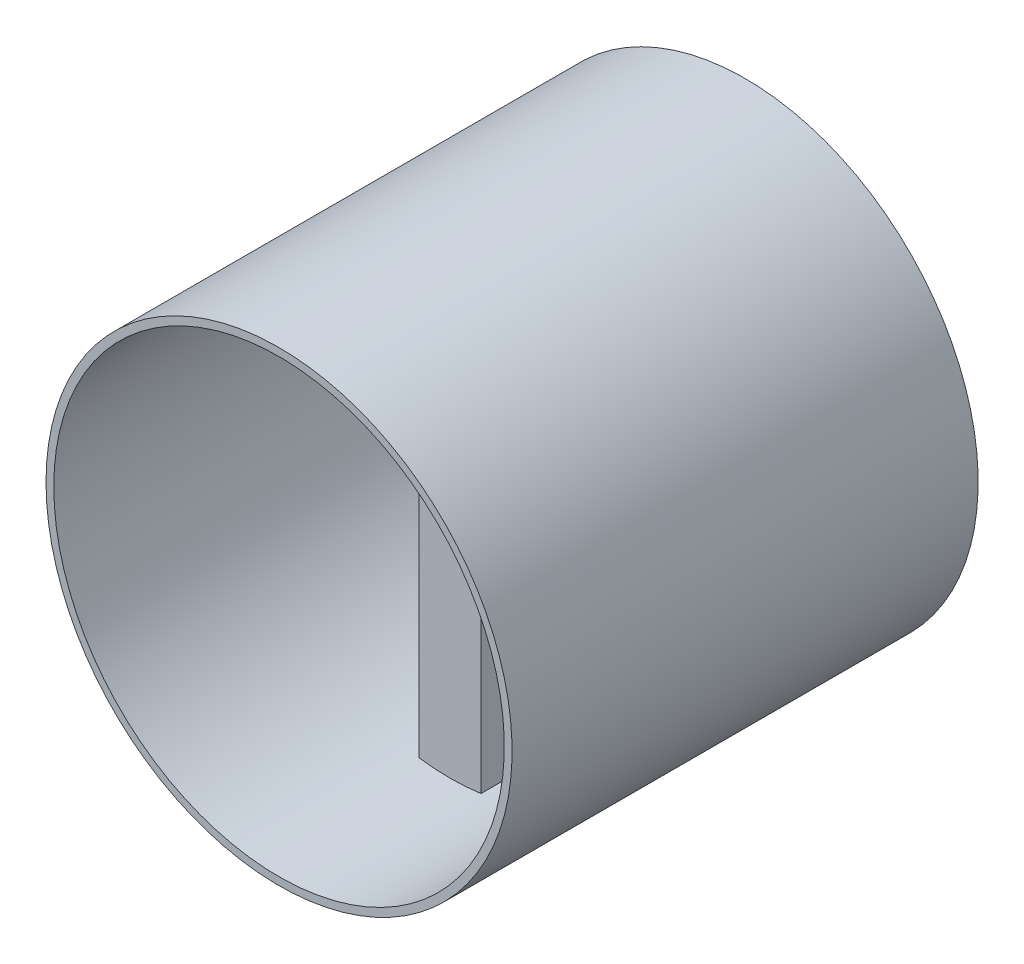
ISO-10303-21;
HEADER;
FILE_DESCRIPTION(('STEP AP214'),'2;1');
FILE_NAME('part.step','',(''),(''),'','','');
FILE_SCHEMA(('AUTOMOTIVE_DESIGN { 1 0 10303 214 1 1 1 1 }'));
ENDSEC;
DATA;
#1=APPLICATION_CONTEXT('core data for automotive mechanical design processes');
#2=APPLICATION_PROTOCOL_DEFINITION('international standard','automotive_design',2000,#1);
#3=PRODUCT_CONTEXT('',#1,'mechanical');
#4=PRODUCT('Part','Part','',(#3));
#5=PRODUCT_RELATED_PRODUCT_CATEGORY('part','',(#4));
#6=PRODUCT_DEFINITION_FORMATION('','',#4);
#7=PRODUCT_DEFINITION_CONTEXT('part definition',#1,'design');
#8=PRODUCT_DEFINITION('design','',#6,#7);
#9=PRODUCT_DEFINITION_SHAPE('','',#8);
#10=(LENGTH_UNIT() NAMED_UNIT(*) SI_UNIT(.MILLI.,.METRE.));
#11=(NAMED_UNIT(*) PLANE_ANGLE_UNIT() SI_UNIT($,.RADIAN.));
#12=(NAMED_UNIT(*) SI_UNIT($,.STERADIAN.) SOLID_ANGLE_UNIT());
#13=UNCERTAINTY_MEASURE_WITH_UNIT(LENGTH_MEASURE(1.E-05),#10,'distance_accuracy_value','');
#14=(GEOMETRIC_REPRESENTATION_CONTEXT(3) GLOBAL_UNCERTAINTY_ASSIGNED_CONTEXT((#13)) GLOBAL_UNIT_ASSIGNED_CONTEXT((#10,
#11,#12)) REPRESENTATION_CONTEXT('',''));
#15=CARTESIAN_POINT('',(0.,0.,0.));
#16=DIRECTION('',(0.,0.,1.));
#17=DIRECTION('',(1.,0.,0.));
#18=AXIS2_PLACEMENT_3D('',#15,#16,#17);
#19=CARTESIAN_POINT('',(0.,0.,60.));
#20=DIRECTION('',(1.,0.,0.));
#21=DIRECTION('',(0.,0.,-1.));
#22=AXIS2_PLACEMENT_3D('',#19,#20,#21);
#23=PLANE('',#22);
#24=DIRECTION('',(0.,-1.,0.));
#25=VECTOR('',#24,1.);
#26=CARTESIAN_POINT('',(0.,0.,38.));
#27=LINE('',#26,#25);
#28=CARTESIAN_POINT('',(0.,58.2228132326902,38.));
#29=VERTEX_POINT('',#28);
#30=CARTESIAN_POINT('',(0.,0.77718676730985,38.));
#31=VERTEX_POINT('',#30);
#32=EDGE_CURVE('E137',#29,#31,#27,.T.);
#33=ORIENTED_EDGE('',*,*,#32,.F.);
#34=DIRECTION('',(0.,0.,-1.));
#35=VECTOR('',#34,1.);
#36=CARTESIAN_POINT('',(0.,58.2228132326901,60.));
#37=LINE('',#36,#35);
#38=CARTESIAN_POINT('',(0.,58.2228132326901,30.));
#39=VERTEX_POINT('',#38);
#40=EDGE_CURVE('E46',#39,#29,#37,.F.);
#41=ORIENTED_EDGE('',*,*,#40,.F.);
#42=DIRECTION('',(0.,1.,0.));
#43=VECTOR('',#42,1.);
#44=CARTESIAN_POINT('',(0.,0.,30.));
#45=LINE('',#44,#43);
#46=CARTESIAN_POINT('',(0.,0.77718676730985,30.));
#47=VERTEX_POINT('',#46);
#48=EDGE_CURVE('E172',#47,#39,#45,.T.);
#49=ORIENTED_EDGE('',*,*,#48,.F.);
#50=DIRECTION('',(0.,0.,-1.));
#51=VECTOR('',#50,1.);
#52=CARTESIAN_POINT('',(0.,0.77718676730985,60.));
#53=LINE('',#52,#51);
#54=EDGE_CURVE('E11',#31,#47,#53,.T.);
#55=ORIENTED_EDGE('',*,*,#54,.F.);
#56=EDGE_LOOP('',(#33,#41,#49,#55));
#57=FACE_BOUND('',#56,.T.);
#58=ADVANCED_FACE('F38',(#57),#23,.F.);
#59=CARTESIAN_POINT('',(8.,0.,60.));
#60=DIRECTION('',(-1.,0.,0.));
#61=DIRECTION('',(0.,-1.,0.));
#62=AXIS2_PLACEMENT_3D('',#59,#60,#61);
#63=PLANE('',#62);
#64=DIRECTION('',(0.,1.,0.));
#65=VECTOR('',#64,1.);
#66=CARTESIAN_POINT('',(8.,0.,38.));
#67=LINE('',#66,#65);
#68=CARTESIAN_POINT('',(8.,0.77718676730985,38.));
#69=VERTEX_POINT('',#68);
#70=CARTESIAN_POINT('',(7.99999999999999,58.2228132326902,38.));
#71=VERTEX_POINT('',#70);
#72=EDGE_CURVE('E126',#69,#71,#67,.T.);
#73=ORIENTED_EDGE('',*,*,#72,.F.);
#74=DIRECTION('',(0.,0.,-1.));
#75=VECTOR('',#74,1.);
#76=CARTESIAN_POINT('',(8.,0.77718676730985,60.));
#77=LINE('',#76,#75);
#78=CARTESIAN_POINT('',(8.,0.77718676730985,30.));
#79=VERTEX_POINT('',#78);
#80=EDGE_CURVE('E153',#79,#69,#77,.F.);
#81=ORIENTED_EDGE('',*,*,#80,.F.);
#82=DIRECTION('',(0.,-1.,0.));
#83=VECTOR('',#82,1.);
#84=CARTESIAN_POINT('',(8.,0.,30.));
#85=LINE('',#84,#83);
#86=CARTESIAN_POINT('',(7.99999999999999,58.2228132326901,30.));
#87=VERTEX_POINT('',#86);
#88=EDGE_CURVE('E151',#87,#79,#85,.T.);
#89=ORIENTED_EDGE('',*,*,#88,.F.);
#90=DIRECTION('',(0.,0.,-1.));
#91=VECTOR('',#90,1.);
#92=CARTESIAN_POINT('',(7.99999999999999,58.2228132326901,60.));
#93=LINE('',#92,#91);
#94=EDGE_CURVE('E144',#71,#87,#93,.T.);
#95=ORIENTED_EDGE('',*,*,#94,.F.);
#96=EDGE_LOOP('',(#73,#81,#89,#95));
#97=FACE_BOUND('',#96,.T.);
#98=ADVANCED_FACE('F150',(#97),#63,.F.);
#99=CARTESIAN_POINT('',(0.,0.,60.));
#100=DIRECTION('',(0.,0.,-1.));
#101=DIRECTION('',(-1.,0.,0.));
#102=AXIS2_PLACEMENT_3D('',#99,#100,#101);
#103=PLANE('',#102);
#104=CARTESIAN_POINT('',(4.,29.5,60.));
#105=DIRECTION('',(0.,0.,-1.));
#106=DIRECTION('',(-1.,0.,0.));
#107=AXIS2_PLACEMENT_3D('',#104,#105,#106);
#108=CIRCLE('',#107,29.);
#109=CARTESIAN_POINT('',(-25.,29.5,60.));
#110=VERTEX_POINT('',#109);
#111=EDGE_CURVE('E164',#110,#110,#108,.T.);
#112=ORIENTED_EDGE('',*,*,#111,.T.);
#113=EDGE_LOOP('',(#112));
#114=FACE_BOUND('',#113,.T.);
#115=CARTESIAN_POINT('',(4.,29.5,60.));
#116=DIRECTION('',(0.,0.,-1.));
#117=DIRECTION('',(-1.,0.,0.));
#118=AXIS2_PLACEMENT_3D('',#115,#116,#117);
#119=CIRCLE('',#118,30.);
#120=CARTESIAN_POINT('',(-26.,29.5,60.));
#121=VERTEX_POINT('',#120);
#122=EDGE_CURVE('E157',#121,#121,#119,.T.);
#123=ORIENTED_EDGE('',*,*,#122,.F.);
#124=EDGE_LOOP('',(#123));
#125=FACE_BOUND('',#124,.T.);
#126=ADVANCED_FACE('F360',(#114,#125),#103,.F.);
#127=CARTESIAN_POINT('',(0.,0.,0.));
#128=DIRECTION('',(0.,0.,-1.));
#129=DIRECTION('',(-1.,0.,0.));
#130=AXIS2_PLACEMENT_3D('',#127,#128,#129);
#131=PLANE('',#130);
#132=CARTESIAN_POINT('',(4.,29.5,0.));
#133=DIRECTION('',(0.,0.,-1.));
#134=DIRECTION('',(-1.,0.,0.));
#135=AXIS2_PLACEMENT_3D('',#132,#133,#134);
#136=CIRCLE('',#135,29.);
#137=CARTESIAN_POINT('',(-25.,29.5,0.));
#138=VERTEX_POINT('',#137);
#139=EDGE_CURVE('E168',#138,#138,#136,.T.);
#140=ORIENTED_EDGE('',*,*,#139,.F.);
#141=EDGE_LOOP('',(#140));
#142=FACE_BOUND('',#141,.T.);
#143=CARTESIAN_POINT('',(4.,29.5,0.));
#144=DIRECTION('',(0.,0.,-1.));
#145=DIRECTION('',(-1.,0.,0.));
#146=AXIS2_PLACEMENT_3D('',#143,#144,#145);
#147=CIRCLE('',#146,30.);
#148=CARTESIAN_POINT('',(-26.,29.5,0.));
#149=VERTEX_POINT('',#148);
#150=EDGE_CURVE('E160',#149,#149,#147,.T.);
#151=ORIENTED_EDGE('',*,*,#150,.T.);
#152=EDGE_LOOP('',(#151));
#153=FACE_BOUND('',#152,.T.);
#154=ADVANCED_FACE('F377',(#142,#153),#131,.T.);
#155=CARTESIAN_POINT('',(4.,29.5,60.));
#156=DIRECTION('',(0.,0.,-1.));
#157=DIRECTION('',(-1.,0.,0.));
#158=AXIS2_PLACEMENT_3D('',#155,#156,#157);
#159=CYLINDRICAL_SURFACE('',#158,29.);
#160=ORIENTED_EDGE('',*,*,#111,.F.);
#161=EDGE_LOOP('',(#160));
#162=FACE_BOUND('',#161,.T.);
#163=CARTESIAN_POINT('',(4.,29.5,38.));
#164=DIRECTION('',(0.,0.,1.));
#165=DIRECTION('',(1.,0.,0.));
#166=AXIS2_PLACEMENT_3D('',#163,#164,#165);
#167=CIRCLE('',#166,29.);
#168=EDGE_CURVE('E131',#31,#69,#167,.T.);
#169=ORIENTED_EDGE('',*,*,#168,.F.);
#170=ORIENTED_EDGE('',*,*,#54,.T.);
#171=CARTESIAN_POINT('',(4.,29.5,30.));
#172=DIRECTION('',(0.,0.,-1.));
#173=DIRECTION('',(-1.,0.,0.));
#174=AXIS2_PLACEMENT_3D('',#171,#172,#173);
#175=CIRCLE('',#174,29.);
#176=EDGE_CURVE('E183',#79,#47,#175,.T.);
#177=ORIENTED_EDGE('',*,*,#176,.F.);
#178=ORIENTED_EDGE('',*,*,#80,.T.);
#179=EDGE_LOOP('',(#169,#170,#177,#178));
#180=FACE_BOUND('',#179,.T.);
#181=ORIENTED_EDGE('',*,*,#40,.T.);
#182=EDGE_CURVE('E129',#71,#29,#167,.T.);
#183=ORIENTED_EDGE('',*,*,#182,.F.);
#184=ORIENTED_EDGE('',*,*,#94,.T.);
#185=EDGE_CURVE('E180',#39,#87,#175,.T.);
#186=ORIENTED_EDGE('',*,*,#185,.F.);
#187=EDGE_LOOP('',(#181,#183,#184,#186));
#188=FACE_BOUND('',#187,.T.);
#189=ORIENTED_EDGE('',*,*,#139,.T.);
#190=EDGE_LOOP('',(#189));
#191=FACE_BOUND('',#190,.T.);
#192=ADVANCED_FACE('F141',(#162,#180,#188,#191),#159,.F.);
#193=CARTESIAN_POINT('',(4.,29.5,60.));
#194=DIRECTION('',(0.,0.,-1.));
#195=DIRECTION('',(-1.,0.,0.));
#196=AXIS2_PLACEMENT_3D('',#193,#194,#195);
#197=CYLINDRICAL_SURFACE('',#196,30.);
#198=ORIENTED_EDGE('',*,*,#122,.T.);
#199=EDGE_LOOP('',(#198));
#200=FACE_BOUND('',#199,.T.);
#201=ORIENTED_EDGE('',*,*,#150,.F.);
#202=EDGE_LOOP('',(#201));
#203=FACE_BOUND('',#202,.T.);
#204=ADVANCED_FACE('F365',(#200,#203),#197,.T.);
#205=CARTESIAN_POINT('',(4.,29.5,30.));
#206=DIRECTION('',(0.,0.,-1.));
#207=DIRECTION('',(-1.,0.,0.));
#208=AXIS2_PLACEMENT_3D('',#205,#206,#207);
#209=PLANE('',#208);
#210=CARTESIAN_POINT('',(4.,29.5,30.));
#211=DIRECTION('',(0.,0.,-1.));
#212=DIRECTION('',(-1.,0.,0.));
#213=AXIS2_PLACEMENT_3D('',#210,#211,#212);
#214=CIRCLE('',#213,3.);
#215=CARTESIAN_POINT('',(6.96725784447476,29.9420190995907,30.));
#216=VERTEX_POINT('',#215);
#217=CARTESIAN_POINT('',(6.96725784447476,29.0579809004093,30.));
#218=VERTEX_POINT('',#217);
#219=EDGE_CURVE('E53',#216,#218,#214,.T.);
#220=ORIENTED_EDGE('',*,*,#219,.F.);
#221=DIRECTION('',(0.0738716855153117,-0.997267754456709,0.));
#222=VECTOR('',#221,1.);
#223=CARTESIAN_POINT('',(6.,43.,30.));
#224=LINE('',#223,#222);
#225=CARTESIAN_POINT('',(6.,43.,30.));
#226=VERTEX_POINT('',#225);
#227=EDGE_CURVE('E209',#226,#216,#224,.T.);
#228=ORIENTED_EDGE('',*,*,#227,.F.);
#229=CARTESIAN_POINT('',(4.,43.,30.));
#230=DIRECTION('',(0.,0.,-1.));
#231=DIRECTION('',(-1.,0.,0.));
#232=AXIS2_PLACEMENT_3D('',#229,#230,#231);
#233=CIRCLE('',#232,2.);
#234=CARTESIAN_POINT('',(2.,43.,30.));
#235=VERTEX_POINT('',#234);
#236=EDGE_CURVE('E214',#235,#226,#233,.T.);
#237=ORIENTED_EDGE('',*,*,#236,.F.);
#238=DIRECTION('',(0.0738716855153117,0.997267754456709,0.));
#239=VECTOR('',#238,1.);
#240=CARTESIAN_POINT('',(1.03274215552524,29.9420190995907,30.));
#241=LINE('',#240,#239);
#242=CARTESIAN_POINT('',(1.03274215552524,29.9420190995907,30.));
#243=VERTEX_POINT('',#242);
#244=EDGE_CURVE('E218',#243,#235,#241,.T.);
#245=ORIENTED_EDGE('',*,*,#244,.F.);
#246=CARTESIAN_POINT('',(4.,29.5,30.));
#247=DIRECTION('',(0.,0.,-1.));
#248=DIRECTION('',(1.,0.,0.));
#249=AXIS2_PLACEMENT_3D('',#246,#247,#248);
#250=CIRCLE('',#249,3.);
#251=CARTESIAN_POINT('',(1.03274215552524,29.0579809004093,30.));
#252=VERTEX_POINT('',#251);
#253=EDGE_CURVE('E222',#252,#243,#250,.T.);
#254=ORIENTED_EDGE('',*,*,#253,.F.);
#255=DIRECTION('',(-0.0738716855153117,0.997267754456709,0.));
#256=VECTOR('',#255,1.);
#257=CARTESIAN_POINT('',(2.,16.,30.));
#258=LINE('',#257,#256);
#259=CARTESIAN_POINT('',(2.,16.,30.));
#260=VERTEX_POINT('',#259);
#261=EDGE_CURVE('E226',#260,#252,#258,.T.);
#262=ORIENTED_EDGE('',*,*,#261,.F.);
#263=CARTESIAN_POINT('',(4.,16.,30.));
#264=DIRECTION('',(0.,0.,-1.));
#265=DIRECTION('',(1.,0.,0.));
#266=AXIS2_PLACEMENT_3D('',#263,#264,#265);
#267=CIRCLE('',#266,2.);
#268=CARTESIAN_POINT('',(6.,16.,30.));
#269=VERTEX_POINT('',#268);
#270=EDGE_CURVE('E230',#269,#260,#267,.T.);
#271=ORIENTED_EDGE('',*,*,#270,.F.);
#272=DIRECTION('',(-0.0738716855153117,-0.997267754456709,0.));
#273=VECTOR('',#272,1.);
#274=CARTESIAN_POINT('',(6.,16.,30.));
#275=LINE('',#274,#273);
#276=EDGE_CURVE('E234',#218,#269,#275,.T.);
#277=ORIENTED_EDGE('',*,*,#276,.F.);
#278=EDGE_LOOP('',(#220,#228,#237,#245,#254,#262,#271,#277));
#279=FACE_BOUND('',#278,.T.);
#280=ORIENTED_EDGE('',*,*,#48,.T.);
#281=ORIENTED_EDGE('',*,*,#185,.T.);
#282=ORIENTED_EDGE('',*,*,#88,.T.);
#283=ORIENTED_EDGE('',*,*,#176,.T.);
#284=EDGE_LOOP('',(#280,#281,#282,#283));
#285=FACE_BOUND('',#284,.T.);
#286=ADVANCED_FACE('F344',(#279,#285),#209,.T.);
#287=CARTESIAN_POINT('',(4.,29.5,31.5));
#288=DIRECTION('',(0.,0.,-1.));
#289=DIRECTION('',(-1.,0.,0.));
#290=AXIS2_PLACEMENT_3D('',#287,#288,#289);
#291=CYLINDRICAL_SURFACE('',#290,3.);
#292=ORIENTED_EDGE('',*,*,#219,.T.);
#293=DIRECTION('',(0.,0.,-1.));
#294=VECTOR('',#293,1.);
#295=CARTESIAN_POINT('',(6.96725784447476,29.0579809004093,31.5));
#296=LINE('',#295,#294);
#297=CARTESIAN_POINT('',(6.96725784447476,29.0579809004093,31.5));
#298=VERTEX_POINT('',#297);
#299=EDGE_CURVE('E184',#298,#218,#296,.T.);
#300=ORIENTED_EDGE('',*,*,#299,.F.);
#301=CARTESIAN_POINT('',(4.,29.5,31.5));
#302=DIRECTION('',(0.,0.,-1.));
#303=DIRECTION('',(-1.,0.,0.));
#304=AXIS2_PLACEMENT_3D('',#301,#302,#303);
#305=CIRCLE('',#304,3.);
#306=CARTESIAN_POINT('',(6.96725784447476,29.9420190995907,31.5));
#307=VERTEX_POINT('',#306);
#308=EDGE_CURVE('E213',#307,#298,#305,.T.);
#309=ORIENTED_EDGE('',*,*,#308,.F.);
#310=DIRECTION('',(0.,0.,-1.));
#311=VECTOR('',#310,1.);
#312=CARTESIAN_POINT('',(6.96725784447476,29.9420190995907,31.5));
#313=LINE('',#312,#311);
#314=EDGE_CURVE('E206',#307,#216,#313,.T.);
#315=ORIENTED_EDGE('',*,*,#314,.T.);
#316=EDGE_LOOP('',(#292,#300,#309,#315));
#317=FACE_BOUND('',#316,.T.);
#318=ADVANCED_FACE('F318',(#317),#291,.F.);
#319=CARTESIAN_POINT('',(6.,43.,31.5));
#320=DIRECTION('',(0.997267754456709,0.0738716855153117,0.));
#321=DIRECTION('',(-0.0738716855153117,0.997267754456709,0.));
#322=AXIS2_PLACEMENT_3D('',#319,#320,#321);
#323=PLANE('',#322);
#324=ORIENTED_EDGE('',*,*,#227,.T.);
#325=ORIENTED_EDGE('',*,*,#314,.F.);
#326=DIRECTION('',(0.0738716855153117,-0.997267754456709,0.));
#327=VECTOR('',#326,1.);
#328=CARTESIAN_POINT('',(6.,43.,31.5));
#329=LINE('',#328,#327);
#330=CARTESIAN_POINT('',(6.,43.,31.5));
#331=VERTEX_POINT('',#330);
#332=EDGE_CURVE('E188',#331,#307,#329,.T.);
#333=ORIENTED_EDGE('',*,*,#332,.F.);
#334=DIRECTION('',(0.,0.,-1.));
#335=VECTOR('',#334,1.);
#336=CARTESIAN_POINT('',(6.,43.,31.5));
#337=LINE('',#336,#335);
#338=EDGE_CURVE('E203',#331,#226,#337,.T.);
#339=ORIENTED_EDGE('',*,*,#338,.T.);
#340=EDGE_LOOP('',(#324,#325,#333,#339));
#341=FACE_BOUND('',#340,.T.);
#342=ADVANCED_FACE('F340',(#341),#323,.F.);
#343=CARTESIAN_POINT('',(4.,43.,31.5));
#344=DIRECTION('',(0.,0.,-1.));
#345=DIRECTION('',(-1.,0.,0.));
#346=AXIS2_PLACEMENT_3D('',#343,#344,#345);
#347=CYLINDRICAL_SURFACE('',#346,2.);
#348=ORIENTED_EDGE('',*,*,#236,.T.);
#349=ORIENTED_EDGE('',*,*,#338,.F.);
#350=CARTESIAN_POINT('',(4.,43.,31.5));
#351=DIRECTION('',(0.,0.,-1.));
#352=DIRECTION('',(-1.,0.,0.));
#353=AXIS2_PLACEMENT_3D('',#350,#351,#352);
#354=CIRCLE('',#353,2.);
#355=CARTESIAN_POINT('',(2.,43.,31.5));
#356=VERTEX_POINT('',#355);
#357=EDGE_CURVE('E243',#356,#331,#354,.T.);
#358=ORIENTED_EDGE('',*,*,#357,.F.);
#359=DIRECTION('',(0.,0.,-1.));
#360=VECTOR('',#359,1.);
#361=CARTESIAN_POINT('',(2.,43.,31.5));
#362=LINE('',#361,#360);
#363=EDGE_CURVE('E200',#356,#235,#362,.T.);
#364=ORIENTED_EDGE('',*,*,#363,.T.);
#365=EDGE_LOOP('',(#348,#349,#358,#364));
#366=FACE_BOUND('',#365,.T.);
#367=ADVANCED_FACE('F346',(#366),#347,.F.);
#368=CARTESIAN_POINT('',(1.03274215552524,29.9420190995907,31.5));
#369=DIRECTION('',(-0.997267754456709,0.0738716855153117,0.));
#370=DIRECTION('',(-0.0738716855153117,-0.997267754456709,0.));
#371=AXIS2_PLACEMENT_3D('',#368,#369,#370);
#372=PLANE('',#371);
#373=ORIENTED_EDGE('',*,*,#244,.T.);
#374=ORIENTED_EDGE('',*,*,#363,.F.);
#375=DIRECTION('',(0.0738716855153117,0.997267754456709,0.));
#376=VECTOR('',#375,1.);
#377=CARTESIAN_POINT('',(1.03274215552524,29.9420190995907,31.5));
#378=LINE('',#377,#376);
#379=CARTESIAN_POINT('',(1.03274215552524,29.9420190995907,31.5));
#380=VERTEX_POINT('',#379);
#381=EDGE_CURVE('E247',#380,#356,#378,.T.);
#382=ORIENTED_EDGE('',*,*,#381,.F.);
#383=DIRECTION('',(0.,0.,-1.));
#384=VECTOR('',#383,1.);
#385=CARTESIAN_POINT('',(1.03274215552524,29.9420190995907,31.5));
#386=LINE('',#385,#384);
#387=EDGE_CURVE('E197',#380,#243,#386,.T.);
#388=ORIENTED_EDGE('',*,*,#387,.T.);
#389=EDGE_LOOP('',(#373,#374,#382,#388));
#390=FACE_BOUND('',#389,.T.);
#391=ADVANCED_FACE('F336',(#390),#372,.F.);
#392=CARTESIAN_POINT('',(4.,29.5,31.5));
#393=DIRECTION('',(0.,0.,-1.));
#394=DIRECTION('',(-1.,0.,0.));
#395=AXIS2_PLACEMENT_3D('',#392,#393,#394);
#396=CYLINDRICAL_SURFACE('',#395,3.);
#397=ORIENTED_EDGE('',*,*,#253,.T.);
#398=ORIENTED_EDGE('',*,*,#387,.F.);
#399=CARTESIAN_POINT('',(4.,29.5,31.5));
#400=DIRECTION('',(0.,0.,-1.));
#401=DIRECTION('',(1.,0.,0.));
#402=AXIS2_PLACEMENT_3D('',#399,#400,#401);
#403=CIRCLE('',#402,3.);
#404=CARTESIAN_POINT('',(1.03274215552524,29.0579809004093,31.5));
#405=VERTEX_POINT('',#404);
#406=EDGE_CURVE('E251',#405,#380,#403,.T.);
#407=ORIENTED_EDGE('',*,*,#406,.F.);
#408=DIRECTION('',(0.,0.,-1.));
#409=VECTOR('',#408,1.);
#410=CARTESIAN_POINT('',(1.03274215552524,29.0579809004093,31.5));
#411=LINE('',#410,#409);
#412=EDGE_CURVE('E194',#405,#252,#411,.T.);
#413=ORIENTED_EDGE('',*,*,#412,.T.);
#414=EDGE_LOOP('',(#397,#398,#407,#413));
#415=FACE_BOUND('',#414,.T.);
#416=ADVANCED_FACE('F332',(#415),#396,.F.);
#417=CARTESIAN_POINT('',(2.,16.,31.5));
#418=DIRECTION('',(-0.997267754456709,-0.0738716855153117,0.));
#419=DIRECTION('',(0.0738716855153117,-0.997267754456709,0.));
#420=AXIS2_PLACEMENT_3D('',#417,#418,#419);
#421=PLANE('',#420);
#422=ORIENTED_EDGE('',*,*,#261,.T.);
#423=ORIENTED_EDGE('',*,*,#412,.F.);
#424=DIRECTION('',(-0.0738716855153117,0.997267754456709,0.));
#425=VECTOR('',#424,1.);
#426=CARTESIAN_POINT('',(2.,16.,31.5));
#427=LINE('',#426,#425);
#428=CARTESIAN_POINT('',(2.,16.,31.5));
#429=VERTEX_POINT('',#428);
#430=EDGE_CURVE('E255',#429,#405,#427,.T.);
#431=ORIENTED_EDGE('',*,*,#430,.F.);
#432=DIRECTION('',(0.,0.,-1.));
#433=VECTOR('',#432,1.);
#434=CARTESIAN_POINT('',(2.,16.,31.5));
#435=LINE('',#434,#433);
#436=EDGE_CURVE('E191',#429,#260,#435,.T.);
#437=ORIENTED_EDGE('',*,*,#436,.T.);
#438=EDGE_LOOP('',(#422,#423,#431,#437));
#439=FACE_BOUND('',#438,.T.);
#440=ADVANCED_FACE('F328',(#439),#421,.F.);
#441=CARTESIAN_POINT('',(4.,16.,31.5));
#442=DIRECTION('',(0.,0.,-1.));
#443=DIRECTION('',(-1.,0.,0.));
#444=AXIS2_PLACEMENT_3D('',#441,#442,#443);
#445=CYLINDRICAL_SURFACE('',#444,2.);
#446=ORIENTED_EDGE('',*,*,#270,.T.);
#447=ORIENTED_EDGE('',*,*,#436,.F.);
#448=CARTESIAN_POINT('',(4.,16.,31.5));
#449=DIRECTION('',(0.,0.,-1.));
#450=DIRECTION('',(1.,0.,0.));
#451=AXIS2_PLACEMENT_3D('',#448,#449,#450);
#452=CIRCLE('',#451,2.);
#453=CARTESIAN_POINT('',(6.,16.,31.5));
#454=VERTEX_POINT('',#453);
#455=EDGE_CURVE('E259',#454,#429,#452,.T.);
#456=ORIENTED_EDGE('',*,*,#455,.F.);
#457=DIRECTION('',(0.,0.,-1.));
#458=VECTOR('',#457,1.);
#459=CARTESIAN_POINT('',(6.,16.,31.5));
#460=LINE('',#459,#458);
#461=EDGE_CURVE('E187',#454,#269,#460,.T.);
#462=ORIENTED_EDGE('',*,*,#461,.T.);
#463=EDGE_LOOP('',(#446,#447,#456,#462));
#464=FACE_BOUND('',#463,.T.);
#465=ADVANCED_FACE('F324',(#464),#445,.F.);
#466=CARTESIAN_POINT('',(6.,16.,31.5));
#467=DIRECTION('',(0.997267754456709,-0.0738716855153117,0.));
#468=DIRECTION('',(0.0738716855153117,0.997267754456709,0.));
#469=AXIS2_PLACEMENT_3D('',#466,#467,#468);
#470=PLANE('',#469);
#471=ORIENTED_EDGE('',*,*,#276,.T.);
#472=ORIENTED_EDGE('',*,*,#461,.F.);
#473=DIRECTION('',(-0.0738716855153117,-0.997267754456709,0.));
#474=VECTOR('',#473,1.);
#475=CARTESIAN_POINT('',(6.,16.,31.5));
#476=LINE('',#475,#474);
#477=EDGE_CURVE('E263',#298,#454,#476,.T.);
#478=ORIENTED_EDGE('',*,*,#477,.F.);
#479=ORIENTED_EDGE('',*,*,#299,.T.);
#480=EDGE_LOOP('',(#471,#472,#478,#479));
#481=FACE_BOUND('',#480,.T.);
#482=ADVANCED_FACE('F309',(#481),#470,.F.);
#483=CARTESIAN_POINT('',(4.,29.5,31.5));
#484=DIRECTION('',(0.,0.,-1.));
#485=DIRECTION('',(-1.,0.,0.));
#486=AXIS2_PLACEMENT_3D('',#483,#484,#485);
#487=PLANE('',#486);
#488=CARTESIAN_POINT('',(4.,43.,31.5));
#489=DIRECTION('',(0.,0.,-1.));
#490=DIRECTION('',(-1.,0.,0.));
#491=AXIS2_PLACEMENT_3D('',#488,#489,#490);
#492=CIRCLE('',#491,0.5);
#493=CARTESIAN_POINT('',(3.5,43.,31.5));
#494=VERTEX_POINT('',#493);
#495=EDGE_CURVE('E289',#494,#494,#492,.T.);
#496=ORIENTED_EDGE('',*,*,#495,.F.);
#497=EDGE_LOOP('',(#496));
#498=FACE_BOUND('',#497,.T.);
#499=CARTESIAN_POINT('',(4.,16.,31.5));
#500=DIRECTION('',(0.,0.,-1.));
#501=DIRECTION('',(1.,0.,0.));
#502=AXIS2_PLACEMENT_3D('',#499,#500,#501);
#503=CIRCLE('',#502,0.5);
#504=CARTESIAN_POINT('',(4.5,16.,31.5));
#505=VERTEX_POINT('',#504);
#506=EDGE_CURVE('E281',#505,#505,#503,.T.);
#507=ORIENTED_EDGE('',*,*,#506,.F.);
#508=EDGE_LOOP('',(#507));
#509=FACE_BOUND('',#508,.T.);
#510=CARTESIAN_POINT('',(4.,29.5,31.5));
#511=DIRECTION('',(0.,0.,-1.));
#512=DIRECTION('',(-1.,0.,0.));
#513=AXIS2_PLACEMENT_3D('',#510,#511,#512);
#514=CIRCLE('',#513,2.);
#515=CARTESIAN_POINT('',(2.,29.5,31.5));
#516=VERTEX_POINT('',#515);
#517=EDGE_CURVE('E272',#516,#516,#514,.T.);
#518=ORIENTED_EDGE('',*,*,#517,.F.);
#519=EDGE_LOOP('',(#518));
#520=FACE_BOUND('',#519,.T.);
#521=ORIENTED_EDGE('',*,*,#308,.T.);
#522=ORIENTED_EDGE('',*,*,#477,.T.);
#523=ORIENTED_EDGE('',*,*,#455,.T.);
#524=ORIENTED_EDGE('',*,*,#430,.T.);
#525=ORIENTED_EDGE('',*,*,#406,.T.);
#526=ORIENTED_EDGE('',*,*,#381,.T.);
#527=ORIENTED_EDGE('',*,*,#357,.T.);
#528=ORIENTED_EDGE('',*,*,#332,.T.);
#529=EDGE_LOOP('',(#521,#522,#523,#524,#525,#526,#527,#528));
#530=FACE_BOUND('',#529,.T.);
#531=ADVANCED_FACE('F306',(#498,#509,#520,#530),#487,.T.);
#532=CARTESIAN_POINT('',(4.,29.5,38.));
#533=DIRECTION('',(0.,0.,1.));
#534=DIRECTION('',(1.,0.,0.));
#535=AXIS2_PLACEMENT_3D('',#532,#533,#534);
#536=PLANE('',#535);
#537=CARTESIAN_POINT('',(4.,29.5,38.));
#538=DIRECTION('',(0.,0.,-1.));
#539=DIRECTION('',(-1.,0.,0.));
#540=AXIS2_PLACEMENT_3D('',#537,#538,#539);
#541=CIRCLE('',#540,2.);
#542=CARTESIAN_POINT('',(2.,29.5,38.));
#543=VERTEX_POINT('',#542);
#544=EDGE_CURVE('E276',#543,#543,#541,.T.);
#545=ORIENTED_EDGE('',*,*,#544,.T.);
#546=EDGE_LOOP('',(#545));
#547=FACE_BOUND('',#546,.T.);
#548=ORIENTED_EDGE('',*,*,#32,.T.);
#549=ORIENTED_EDGE('',*,*,#168,.T.);
#550=ORIENTED_EDGE('',*,*,#72,.T.);
#551=ORIENTED_EDGE('',*,*,#182,.T.);
#552=EDGE_LOOP('',(#548,#549,#550,#551));
#553=FACE_BOUND('',#552,.T.);
#554=ADVANCED_FACE('F128',(#547,#553),#536,.T.);
#555=CARTESIAN_POINT('',(4.,29.5,38.));
#556=DIRECTION('',(0.,0.,-1.));
#557=DIRECTION('',(-1.,0.,0.));
#558=AXIS2_PLACEMENT_3D('',#555,#556,#557);
#559=CYLINDRICAL_SURFACE('',#558,2.);
#560=ORIENTED_EDGE('',*,*,#544,.F.);
#561=EDGE_LOOP('',(#560));
#562=FACE_BOUND('',#561,.T.);
#563=ORIENTED_EDGE('',*,*,#517,.T.);
#564=EDGE_LOOP('',(#563));
#565=FACE_BOUND('',#564,.T.);
#566=ADVANCED_FACE('F496',(#562,#565),#559,.F.);
#567=CARTESIAN_POINT('',(4.,16.,35.5));
#568=DIRECTION('',(0.,0.,-1.));
#569=DIRECTION('',(-1.,0.,0.));
#570=AXIS2_PLACEMENT_3D('',#567,#568,#569);
#571=CYLINDRICAL_SURFACE('',#570,0.5);
#572=CARTESIAN_POINT('',(4.,16.,35.5));
#573=DIRECTION('',(0.,0.,-1.));
#574=DIRECTION('',(1.,0.,0.));
#575=AXIS2_PLACEMENT_3D('',#572,#573,#574);
#576=CIRCLE('',#575,0.5);
#577=CARTESIAN_POINT('',(4.5,16.,35.5));
#578=VERTEX_POINT('',#577);
#579=EDGE_CURVE('E285',#578,#578,#576,.T.);
#580=ORIENTED_EDGE('',*,*,#579,.F.);
#581=EDGE_LOOP('',(#580));
#582=FACE_BOUND('',#581,.T.);
#583=ORIENTED_EDGE('',*,*,#506,.T.);
#584=EDGE_LOOP('',(#583));
#585=FACE_BOUND('',#584,.T.);
#586=ADVANCED_FACE('F500',(#582,#585),#571,.F.);
#587=CARTESIAN_POINT('',(4.,16.,35.5));
#588=DIRECTION('',(0.,0.,1.));
#589=DIRECTION('',(1.,0.,0.));
#590=AXIS2_PLACEMENT_3D('',#587,#588,#589);
#591=PLANE('',#590);
#592=ORIENTED_EDGE('',*,*,#579,.T.);
#593=EDGE_LOOP('',(#592));
#594=FACE_BOUND('',#593,.T.);
#595=ADVANCED_FACE('F302',(#594),#591,.F.);
#596=CARTESIAN_POINT('',(4.,43.,35.5));
#597=DIRECTION('',(0.,0.,-1.));
#598=DIRECTION('',(-1.,0.,0.));
#599=AXIS2_PLACEMENT_3D('',#596,#597,#598);
#600=CYLINDRICAL_SURFACE('',#599,0.5);
#601=CARTESIAN_POINT('',(4.,43.,35.5));
#602=DIRECTION('',(0.,0.,-1.));
#603=DIRECTION('',(-1.,0.,0.));
#604=AXIS2_PLACEMENT_3D('',#601,#602,#603);
#605=CIRCLE('',#604,0.5);
#606=CARTESIAN_POINT('',(3.5,43.,35.5));
#607=VERTEX_POINT('',#606);
#608=EDGE_CURVE('E277',#607,#607,#605,.T.);
#609=ORIENTED_EDGE('',*,*,#608,.F.);
#610=EDGE_LOOP('',(#609));
#611=FACE_BOUND('',#610,.T.);
#612=ORIENTED_EDGE('',*,*,#495,.T.);
#613=EDGE_LOOP('',(#612));
#614=FACE_BOUND('',#613,.T.);
#615=ADVANCED_FACE('F299',(#611,#614),#600,.F.);
#616=CARTESIAN_POINT('',(4.,43.,35.5));
#617=DIRECTION('',(0.,0.,-1.));
#618=DIRECTION('',(-1.,0.,0.));
#619=AXIS2_PLACEMENT_3D('',#616,#617,#618);
#620=PLANE('',#619);
#621=ORIENTED_EDGE('',*,*,#608,.T.);
#622=EDGE_LOOP('',(#621));
#623=FACE_BOUND('',#622,.T.);
#624=ADVANCED_FACE('F297',(#623),#620,.T.);
#625=CLOSED_SHELL('',(#58,#98,#126,#154,#192,#204,#286,#318,#342,#367,#391,#416,#440,#465,#482,
#531,#554,#566,#586,#595,#615,#624));
#626=MANIFOLD_SOLID_BREP('B2',#625);
#627=ADVANCED_BREP_SHAPE_REPRESENTATION('',(#18,#626),#14);
#628=SHAPE_DEFINITION_REPRESENTATION(#9,#627);
ENDSEC;
END-ISO-10303-21;
